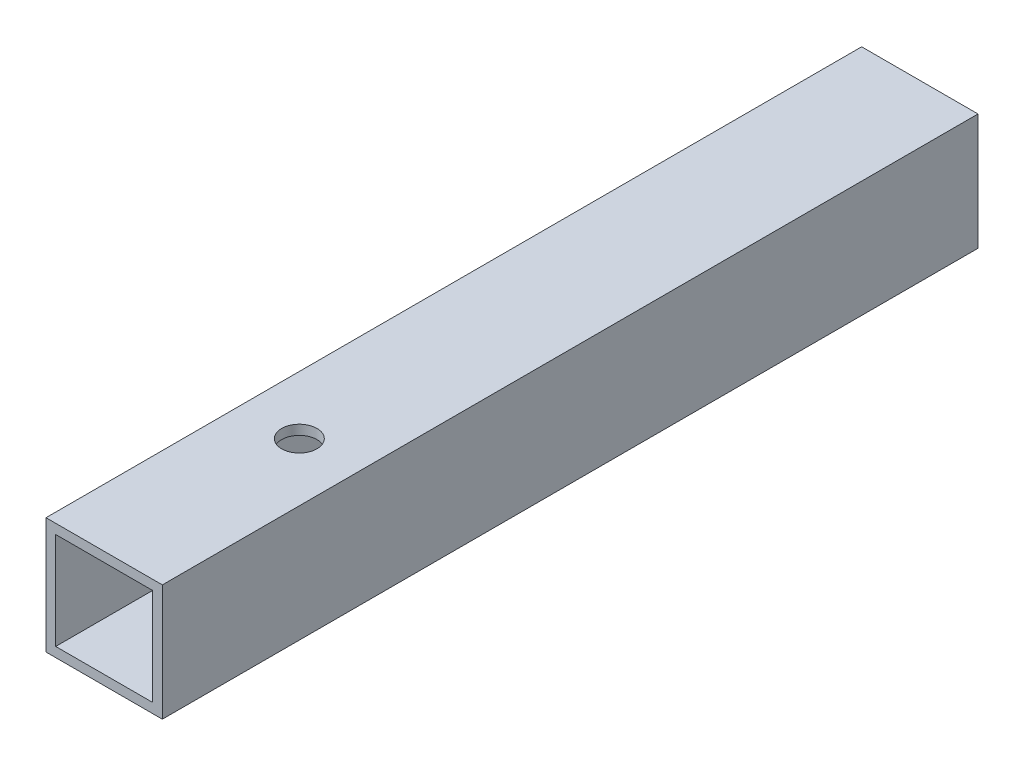
ISO-10303-21;
HEADER;
FILE_DESCRIPTION(('STEP AP214'),'2;1');
FILE_NAME('part.step','',(''),(''),'','','');
FILE_SCHEMA(('AUTOMOTIVE_DESIGN { 1 0 10303 214 1 1 1 1 }'));
ENDSEC;
DATA;
#1=APPLICATION_CONTEXT('core data for automotive mechanical design processes');
#2=APPLICATION_PROTOCOL_DEFINITION('international standard','automotive_design',2000,#1);
#3=PRODUCT_CONTEXT('',#1,'mechanical');
#4=PRODUCT('Part','Part','',(#3));
#5=PRODUCT_RELATED_PRODUCT_CATEGORY('part','',(#4));
#6=PRODUCT_DEFINITION_FORMATION('','',#4);
#7=PRODUCT_DEFINITION_CONTEXT('part definition',#1,'design');
#8=PRODUCT_DEFINITION('design','',#6,#7);
#9=PRODUCT_DEFINITION_SHAPE('','',#8);
#10=(LENGTH_UNIT() NAMED_UNIT(*) SI_UNIT(.MILLI.,.METRE.));
#11=(NAMED_UNIT(*) PLANE_ANGLE_UNIT() SI_UNIT($,.RADIAN.));
#12=(NAMED_UNIT(*) SI_UNIT($,.STERADIAN.) SOLID_ANGLE_UNIT());
#13=UNCERTAINTY_MEASURE_WITH_UNIT(LENGTH_MEASURE(1.E-05),#10,'distance_accuracy_value','');
#14=(GEOMETRIC_REPRESENTATION_CONTEXT(3) GLOBAL_UNCERTAINTY_ASSIGNED_CONTEXT((#13)) GLOBAL_UNIT_ASSIGNED_CONTEXT((#10,
#11,#12)) REPRESENTATION_CONTEXT('',''));
#15=CARTESIAN_POINT('',(0.,0.,0.));
#16=DIRECTION('',(0.,0.,1.));
#17=DIRECTION('',(1.,0.,0.));
#18=AXIS2_PLACEMENT_3D('',#15,#16,#17);
#19=CARTESIAN_POINT('',(0.,0.,66.7766));
#20=DIRECTION('',(0.,0.,1.));
#21=DIRECTION('',(1.,0.,0.));
#22=AXIS2_PLACEMENT_3D('',#19,#20,#21);
#23=PLANE('',#22);
#24=DIRECTION('',(1.,0.,0.));
#25=VECTOR('',#24,1.);
#26=CARTESIAN_POINT('',(9.525,-9.525,66.7766));
#27=LINE('',#26,#25);
#28=CARTESIAN_POINT('',(-9.525,-9.525,66.7766));
#29=VERTEX_POINT('',#28);
#30=CARTESIAN_POINT('',(9.525,-9.525,66.7766));
#31=VERTEX_POINT('',#30);
#32=EDGE_CURVE('E139',#29,#31,#27,.T.);
#33=ORIENTED_EDGE('',*,*,#32,.T.);
#34=DIRECTION('',(0.,1.,0.));
#35=VECTOR('',#34,1.);
#36=CARTESIAN_POINT('',(9.525,9.525,66.7766));
#37=LINE('',#36,#35);
#38=CARTESIAN_POINT('',(9.525,9.525,66.7766));
#39=VERTEX_POINT('',#38);
#40=EDGE_CURVE('E142',#31,#39,#37,.T.);
#41=ORIENTED_EDGE('',*,*,#40,.T.);
#42=DIRECTION('',(-1.,0.,0.));
#43=VECTOR('',#42,1.);
#44=CARTESIAN_POINT('',(9.525,9.525,66.7766));
#45=LINE('',#44,#43);
#46=CARTESIAN_POINT('',(-9.525,9.525,66.7766));
#47=VERTEX_POINT('',#46);
#48=EDGE_CURVE('E145',#39,#47,#45,.T.);
#49=ORIENTED_EDGE('',*,*,#48,.T.);
#50=DIRECTION('',(0.,-1.,0.));
#51=VECTOR('',#50,1.);
#52=CARTESIAN_POINT('',(-9.525,9.525,66.7766));
#53=LINE('',#52,#51);
#54=EDGE_CURVE('E147',#47,#29,#53,.T.);
#55=ORIENTED_EDGE('',*,*,#54,.T.);
#56=EDGE_LOOP('',(#33,#41,#49,#55));
#57=FACE_BOUND('',#56,.T.);
#58=DIRECTION('',(0.,1.,0.));
#59=VECTOR('',#58,1.);
#60=CARTESIAN_POINT('',(7.9375,7.9375,66.7766));
#61=LINE('',#60,#59);
#62=CARTESIAN_POINT('',(7.9375,-7.9375,66.7766));
#63=VERTEX_POINT('',#62);
#64=CARTESIAN_POINT('',(7.9375,7.9375,66.7766));
#65=VERTEX_POINT('',#64);
#66=EDGE_CURVE('E109',#63,#65,#61,.T.);
#67=ORIENTED_EDGE('',*,*,#66,.F.);
#68=DIRECTION('',(1.,0.,0.));
#69=VECTOR('',#68,1.);
#70=CARTESIAN_POINT('',(7.9375,-7.9375,66.7766));
#71=LINE('',#70,#69);
#72=CARTESIAN_POINT('',(-7.9375,-7.9375,66.7766));
#73=VERTEX_POINT('',#72);
#74=EDGE_CURVE('E101',#73,#63,#71,.T.);
#75=ORIENTED_EDGE('',*,*,#74,.F.);
#76=DIRECTION('',(0.,-1.,0.));
#77=VECTOR('',#76,1.);
#78=CARTESIAN_POINT('',(-7.9375,7.9375,66.7766));
#79=LINE('',#78,#77);
#80=CARTESIAN_POINT('',(-7.9375,7.9375,66.7766));
#81=VERTEX_POINT('',#80);
#82=EDGE_CURVE('E123',#81,#73,#79,.T.);
#83=ORIENTED_EDGE('',*,*,#82,.F.);
#84=DIRECTION('',(-1.,0.,0.));
#85=VECTOR('',#84,1.);
#86=CARTESIAN_POINT('',(7.9375,7.9375,66.7766));
#87=LINE('',#86,#85);
#88=EDGE_CURVE('E121',#65,#81,#87,.T.);
#89=ORIENTED_EDGE('',*,*,#88,.F.);
#90=EDGE_LOOP('',(#67,#75,#83,#89));
#91=FACE_BOUND('',#90,.T.);
#92=ADVANCED_FACE('F35',(#57,#91),#23,.T.);
#93=CARTESIAN_POINT('',(0.,0.,-66.7766));
#94=DIRECTION('',(0.,0.,1.));
#95=DIRECTION('',(1.,0.,0.));
#96=AXIS2_PLACEMENT_3D('',#93,#94,#95);
#97=PLANE('',#96);
#98=DIRECTION('',(1.,0.,0.));
#99=VECTOR('',#98,1.);
#100=CARTESIAN_POINT('',(9.525,-9.525,-66.7766));
#101=LINE('',#100,#99);
#102=CARTESIAN_POINT('',(-9.525,-9.525,-66.7766));
#103=VERTEX_POINT('',#102);
#104=CARTESIAN_POINT('',(9.525,-9.525,-66.7766));
#105=VERTEX_POINT('',#104);
#106=EDGE_CURVE('E117',#103,#105,#101,.T.);
#107=ORIENTED_EDGE('',*,*,#106,.F.);
#108=DIRECTION('',(0.,-1.,0.));
#109=VECTOR('',#108,1.);
#110=CARTESIAN_POINT('',(-9.525,9.525,-66.7766));
#111=LINE('',#110,#109);
#112=CARTESIAN_POINT('',(-9.525,9.525,-66.7766));
#113=VERTEX_POINT('',#112);
#114=EDGE_CURVE('E143',#113,#103,#111,.T.);
#115=ORIENTED_EDGE('',*,*,#114,.F.);
#116=DIRECTION('',(-1.,0.,0.));
#117=VECTOR('',#116,1.);
#118=CARTESIAN_POINT('',(9.525,9.525,-66.7766));
#119=LINE('',#118,#117);
#120=CARTESIAN_POINT('',(9.525,9.525,-66.7766));
#121=VERTEX_POINT('',#120);
#122=EDGE_CURVE('E154',#121,#113,#119,.T.);
#123=ORIENTED_EDGE('',*,*,#122,.F.);
#124=DIRECTION('',(0.,1.,0.));
#125=VECTOR('',#124,1.);
#126=CARTESIAN_POINT('',(9.525,9.525,-66.7766));
#127=LINE('',#126,#125);
#128=EDGE_CURVE('E152',#105,#121,#127,.T.);
#129=ORIENTED_EDGE('',*,*,#128,.F.);
#130=EDGE_LOOP('',(#107,#115,#123,#129));
#131=FACE_BOUND('',#130,.T.);
#132=DIRECTION('',(1.,0.,0.));
#133=VECTOR('',#132,1.);
#134=CARTESIAN_POINT('',(7.9375,-7.9375,-66.7766));
#135=LINE('',#134,#133);
#136=CARTESIAN_POINT('',(-7.9375,-7.9375,-66.7766));
#137=VERTEX_POINT('',#136);
#138=CARTESIAN_POINT('',(7.9375,-7.9375,-66.7766));
#139=VERTEX_POINT('',#138);
#140=EDGE_CURVE('E59',#137,#139,#135,.T.);
#141=ORIENTED_EDGE('',*,*,#140,.T.);
#142=DIRECTION('',(0.,1.,0.));
#143=VECTOR('',#142,1.);
#144=CARTESIAN_POINT('',(7.9375,7.9375,-66.7766));
#145=LINE('',#144,#143);
#146=CARTESIAN_POINT('',(7.9375,7.9375,-66.7766));
#147=VERTEX_POINT('',#146);
#148=EDGE_CURVE('E116',#139,#147,#145,.T.);
#149=ORIENTED_EDGE('',*,*,#148,.T.);
#150=DIRECTION('',(-1.,0.,0.));
#151=VECTOR('',#150,1.);
#152=CARTESIAN_POINT('',(7.9375,7.9375,-66.7766));
#153=LINE('',#152,#151);
#154=CARTESIAN_POINT('',(-7.9375,7.9375,-66.7766));
#155=VERTEX_POINT('',#154);
#156=EDGE_CURVE('E131',#147,#155,#153,.T.);
#157=ORIENTED_EDGE('',*,*,#156,.T.);
#158=DIRECTION('',(0.,-1.,0.));
#159=VECTOR('',#158,1.);
#160=CARTESIAN_POINT('',(-7.9375,7.9375,-66.7766));
#161=LINE('',#160,#159);
#162=EDGE_CURVE('E110',#155,#137,#161,.T.);
#163=ORIENTED_EDGE('',*,*,#162,.T.);
#164=EDGE_LOOP('',(#141,#149,#157,#163));
#165=FACE_BOUND('',#164,.T.);
#166=ADVANCED_FACE('F173',(#131,#165),#97,.F.);
#167=CARTESIAN_POINT('',(9.525,-9.525,66.7766));
#168=DIRECTION('',(0.,1.,0.));
#169=DIRECTION('',(-1.,0.,0.));
#170=AXIS2_PLACEMENT_3D('',#167,#168,#169);
#171=PLANE('',#170);
#172=CARTESIAN_POINT('',(0.,-9.52500000000001,34.8234));
#173=DIRECTION('',(0.,1.,0.));
#174=DIRECTION('',(-1.,0.,0.));
#175=AXIS2_PLACEMENT_3D('',#172,#173,#174);
#176=CIRCLE('',#175,2.8956);
#177=CARTESIAN_POINT('',(-2.8956,-9.52500000000001,34.8234));
#178=VERTEX_POINT('',#177);
#179=EDGE_CURVE('E215',#178,#178,#176,.T.);
#180=ORIENTED_EDGE('',*,*,#179,.T.);
#181=EDGE_LOOP('',(#180));
#182=FACE_BOUND('',#181,.T.);
#183=ORIENTED_EDGE('',*,*,#106,.T.);
#184=DIRECTION('',(0.,0.,-1.));
#185=VECTOR('',#184,1.);
#186=CARTESIAN_POINT('',(9.525,-9.525,66.7766));
#187=LINE('',#186,#185);
#188=EDGE_CURVE('E11',#31,#105,#187,.T.);
#189=ORIENTED_EDGE('',*,*,#188,.F.);
#190=ORIENTED_EDGE('',*,*,#32,.F.);
#191=DIRECTION('',(0.,0.,-1.));
#192=VECTOR('',#191,1.);
#193=CARTESIAN_POINT('',(-9.525,-9.525,66.7766));
#194=LINE('',#193,#192);
#195=EDGE_CURVE('E149',#29,#103,#194,.T.);
#196=ORIENTED_EDGE('',*,*,#195,.T.);
#197=EDGE_LOOP('',(#183,#189,#190,#196));
#198=FACE_BOUND('',#197,.T.);
#199=ADVANCED_FACE('F37',(#182,#198),#171,.F.);
#200=CARTESIAN_POINT('',(9.525,9.525,66.7766));
#201=DIRECTION('',(-1.,0.,0.));
#202=DIRECTION('',(0.,0.,1.));
#203=AXIS2_PLACEMENT_3D('',#200,#201,#202);
#204=PLANE('',#203);
#205=ORIENTED_EDGE('',*,*,#128,.T.);
#206=DIRECTION('',(0.,0.,-1.));
#207=VECTOR('',#206,1.);
#208=CARTESIAN_POINT('',(9.525,9.525,66.7766));
#209=LINE('',#208,#207);
#210=EDGE_CURVE('E44',#39,#121,#209,.T.);
#211=ORIENTED_EDGE('',*,*,#210,.F.);
#212=ORIENTED_EDGE('',*,*,#40,.F.);
#213=ORIENTED_EDGE('',*,*,#188,.T.);
#214=EDGE_LOOP('',(#205,#211,#212,#213));
#215=FACE_BOUND('',#214,.T.);
#216=ADVANCED_FACE('F183',(#215),#204,.F.);
#217=CARTESIAN_POINT('',(9.525,9.525,66.7766));
#218=DIRECTION('',(0.,-1.,0.));
#219=DIRECTION('',(1.,0.,0.));
#220=AXIS2_PLACEMENT_3D('',#217,#218,#219);
#221=PLANE('',#220);
#222=CARTESIAN_POINT('',(0.,9.525,34.8234));
#223=DIRECTION('',(0.,1.,0.));
#224=DIRECTION('',(-1.,0.,0.));
#225=AXIS2_PLACEMENT_3D('',#222,#223,#224);
#226=CIRCLE('',#225,2.8956);
#227=CARTESIAN_POINT('',(-2.8956,9.525,34.8234));
#228=VERTEX_POINT('',#227);
#229=EDGE_CURVE('E211',#228,#228,#226,.T.);
#230=ORIENTED_EDGE('',*,*,#229,.F.);
#231=EDGE_LOOP('',(#230));
#232=FACE_BOUND('',#231,.T.);
#233=ORIENTED_EDGE('',*,*,#122,.T.);
#234=DIRECTION('',(0.,0.,-1.));
#235=VECTOR('',#234,1.);
#236=CARTESIAN_POINT('',(-9.525,9.525,66.7766));
#237=LINE('',#236,#235);
#238=EDGE_CURVE('E159',#47,#113,#237,.T.);
#239=ORIENTED_EDGE('',*,*,#238,.F.);
#240=ORIENTED_EDGE('',*,*,#48,.F.);
#241=ORIENTED_EDGE('',*,*,#210,.T.);
#242=EDGE_LOOP('',(#233,#239,#240,#241));
#243=FACE_BOUND('',#242,.T.);
#244=ADVANCED_FACE('F167',(#232,#243),#221,.F.);
#245=CARTESIAN_POINT('',(-9.525,9.525,66.7766));
#246=DIRECTION('',(1.,0.,0.));
#247=DIRECTION('',(0.,0.,-1.));
#248=AXIS2_PLACEMENT_3D('',#245,#246,#247);
#249=PLANE('',#248);
#250=CARTESIAN_POINT('',(-9.525,0.,3.3782));
#251=DIRECTION('',(-1.,0.,0.));
#252=DIRECTION('',(0.,0.,1.));
#253=AXIS2_PLACEMENT_3D('',#250,#251,#252);
#254=CIRCLE('',#253,4.7625);
#255=CARTESIAN_POINT('',(-9.525,0.,8.1407));
#256=VERTEX_POINT('',#255);
#257=EDGE_CURVE('E209',#256,#256,#254,.T.);
#258=ORIENTED_EDGE('',*,*,#257,.F.);
#259=EDGE_LOOP('',(#258));
#260=FACE_BOUND('',#259,.T.);
#261=ORIENTED_EDGE('',*,*,#114,.T.);
#262=ORIENTED_EDGE('',*,*,#195,.F.);
#263=ORIENTED_EDGE('',*,*,#54,.F.);
#264=ORIENTED_EDGE('',*,*,#238,.T.);
#265=EDGE_LOOP('',(#261,#262,#263,#264));
#266=FACE_BOUND('',#265,.T.);
#267=ADVANCED_FACE('F177',(#260,#266),#249,.F.);
#268=CARTESIAN_POINT('',(7.9375,-7.9375,66.7766));
#269=DIRECTION('',(0.,1.,0.));
#270=DIRECTION('',(-1.,0.,0.));
#271=AXIS2_PLACEMENT_3D('',#268,#269,#270);
#272=PLANE('',#271);
#273=CARTESIAN_POINT('',(0.,-7.9375,34.8234));
#274=DIRECTION('',(0.,1.,0.));
#275=DIRECTION('',(-1.,0.,0.));
#276=AXIS2_PLACEMENT_3D('',#273,#274,#275);
#277=CIRCLE('',#276,2.8956);
#278=CARTESIAN_POINT('',(-2.8956,-7.9375,34.8234));
#279=VERTEX_POINT('',#278);
#280=EDGE_CURVE('E129',#279,#279,#277,.T.);
#281=ORIENTED_EDGE('',*,*,#280,.F.);
#282=EDGE_LOOP('',(#281));
#283=FACE_BOUND('',#282,.T.);
#284=ORIENTED_EDGE('',*,*,#140,.F.);
#285=DIRECTION('',(0.,0.,-1.));
#286=VECTOR('',#285,1.);
#287=CARTESIAN_POINT('',(-7.9375,-7.9375,66.7766));
#288=LINE('',#287,#286);
#289=EDGE_CURVE('E105',#73,#137,#288,.T.);
#290=ORIENTED_EDGE('',*,*,#289,.F.);
#291=ORIENTED_EDGE('',*,*,#74,.T.);
#292=DIRECTION('',(0.,0.,-1.));
#293=VECTOR('',#292,1.);
#294=CARTESIAN_POINT('',(7.9375,-7.9375,66.7766));
#295=LINE('',#294,#293);
#296=EDGE_CURVE('E104',#63,#139,#295,.T.);
#297=ORIENTED_EDGE('',*,*,#296,.T.);
#298=EDGE_LOOP('',(#284,#290,#291,#297));
#299=FACE_BOUND('',#298,.T.);
#300=ADVANCED_FACE('F103',(#283,#299),#272,.T.);
#301=CARTESIAN_POINT('',(7.9375,7.9375,66.7766));
#302=DIRECTION('',(-1.,0.,0.));
#303=DIRECTION('',(0.,0.,1.));
#304=AXIS2_PLACEMENT_3D('',#301,#302,#303);
#305=PLANE('',#304);
#306=ORIENTED_EDGE('',*,*,#148,.F.);
#307=ORIENTED_EDGE('',*,*,#296,.F.);
#308=ORIENTED_EDGE('',*,*,#66,.T.);
#309=DIRECTION('',(0.,0.,-1.));
#310=VECTOR('',#309,1.);
#311=CARTESIAN_POINT('',(7.9375,7.9375,66.7766));
#312=LINE('',#311,#310);
#313=EDGE_CURVE('E118',#65,#147,#312,.T.);
#314=ORIENTED_EDGE('',*,*,#313,.T.);
#315=EDGE_LOOP('',(#306,#307,#308,#314));
#316=FACE_BOUND('',#315,.T.);
#317=ADVANCED_FACE('F113',(#316),#305,.T.);
#318=CARTESIAN_POINT('',(7.9375,7.9375,66.7766));
#319=DIRECTION('',(0.,-1.,0.));
#320=DIRECTION('',(1.,0.,0.));
#321=AXIS2_PLACEMENT_3D('',#318,#319,#320);
#322=PLANE('',#321);
#323=CARTESIAN_POINT('',(0.,7.9375,34.8234));
#324=DIRECTION('',(0.,-1.,0.));
#325=DIRECTION('',(1.,0.,0.));
#326=AXIS2_PLACEMENT_3D('',#323,#324,#325);
#327=CIRCLE('',#326,2.8956);
#328=CARTESIAN_POINT('',(2.8956,7.9375,34.8234));
#329=VERTEX_POINT('',#328);
#330=EDGE_CURVE('E39',#329,#329,#327,.T.);
#331=ORIENTED_EDGE('',*,*,#330,.F.);
#332=EDGE_LOOP('',(#331));
#333=FACE_BOUND('',#332,.T.);
#334=ORIENTED_EDGE('',*,*,#156,.F.);
#335=ORIENTED_EDGE('',*,*,#313,.F.);
#336=ORIENTED_EDGE('',*,*,#88,.T.);
#337=DIRECTION('',(0.,0.,-1.));
#338=VECTOR('',#337,1.);
#339=CARTESIAN_POINT('',(-7.9375,7.9375,66.7766));
#340=LINE('',#339,#338);
#341=EDGE_CURVE('E51',#81,#155,#340,.T.);
#342=ORIENTED_EDGE('',*,*,#341,.T.);
#343=EDGE_LOOP('',(#334,#335,#336,#342));
#344=FACE_BOUND('',#343,.T.);
#345=ADVANCED_FACE('F230',(#333,#344),#322,.T.);
#346=CARTESIAN_POINT('',(-7.9375,7.9375,66.7766));
#347=DIRECTION('',(1.,0.,0.));
#348=DIRECTION('',(0.,0.,-1.));
#349=AXIS2_PLACEMENT_3D('',#346,#347,#348);
#350=PLANE('',#349);
#351=CARTESIAN_POINT('',(-7.9375,0.,3.3782));
#352=DIRECTION('',(1.,0.,0.));
#353=DIRECTION('',(0.,0.,-1.));
#354=AXIS2_PLACEMENT_3D('',#351,#352,#353);
#355=CIRCLE('',#354,4.7625);
#356=CARTESIAN_POINT('',(-7.9375,0.,-1.3843));
#357=VERTEX_POINT('',#356);
#358=EDGE_CURVE('E212',#357,#357,#355,.F.);
#359=ORIENTED_EDGE('',*,*,#358,.T.);
#360=EDGE_LOOP('',(#359));
#361=FACE_BOUND('',#360,.T.);
#362=ORIENTED_EDGE('',*,*,#162,.F.);
#363=ORIENTED_EDGE('',*,*,#341,.F.);
#364=ORIENTED_EDGE('',*,*,#82,.T.);
#365=ORIENTED_EDGE('',*,*,#289,.T.);
#366=EDGE_LOOP('',(#362,#363,#364,#365));
#367=FACE_BOUND('',#366,.T.);
#368=ADVANCED_FACE('F233',(#361,#367),#350,.T.);
#369=CARTESIAN_POINT('',(0.,-9.52500000000001,34.8234));
#370=DIRECTION('',(0.,1.,0.));
#371=DIRECTION('',(-1.,0.,0.));
#372=AXIS2_PLACEMENT_3D('',#369,#370,#371);
#373=CYLINDRICAL_SURFACE('',#372,2.8956);
#374=ORIENTED_EDGE('',*,*,#330,.T.);
#375=EDGE_LOOP('',(#374));
#376=FACE_BOUND('',#375,.T.);
#377=ORIENTED_EDGE('',*,*,#229,.T.);
#378=EDGE_LOOP('',(#377));
#379=FACE_BOUND('',#378,.T.);
#380=ADVANCED_FACE('F227',(#376,#379),#373,.F.);
#381=ORIENTED_EDGE('',*,*,#280,.T.);
#382=EDGE_LOOP('',(#381));
#383=FACE_BOUND('',#382,.T.);
#384=ORIENTED_EDGE('',*,*,#179,.F.);
#385=EDGE_LOOP('',(#384));
#386=FACE_BOUND('',#385,.T.);
#387=ADVANCED_FACE('F242',(#383,#386),#373,.F.);
#388=CARTESIAN_POINT('',(9.526,0.,3.3782));
#389=DIRECTION('',(-1.,0.,0.));
#390=DIRECTION('',(0.,0.,1.));
#391=AXIS2_PLACEMENT_3D('',#388,#389,#390);
#392=CYLINDRICAL_SURFACE('',#391,4.7625);
#393=ORIENTED_EDGE('',*,*,#358,.F.);
#394=EDGE_LOOP('',(#393));
#395=FACE_BOUND('',#394,.T.);
#396=ORIENTED_EDGE('',*,*,#257,.T.);
#397=EDGE_LOOP('',(#396));
#398=FACE_BOUND('',#397,.T.);
#399=ADVANCED_FACE('F274',(#395,#398),#392,.F.);
#400=CLOSED_SHELL('',(#92,#166,#199,#216,#244,#267,#300,#317,#345,#368,#380,#387,#399));
#401=MANIFOLD_SOLID_BREP('B2',#400);
#402=ADVANCED_BREP_SHAPE_REPRESENTATION('',(#18,#401),#14);
#403=SHAPE_DEFINITION_REPRESENTATION(#9,#402);
ENDSEC;
END-ISO-10303-21;
